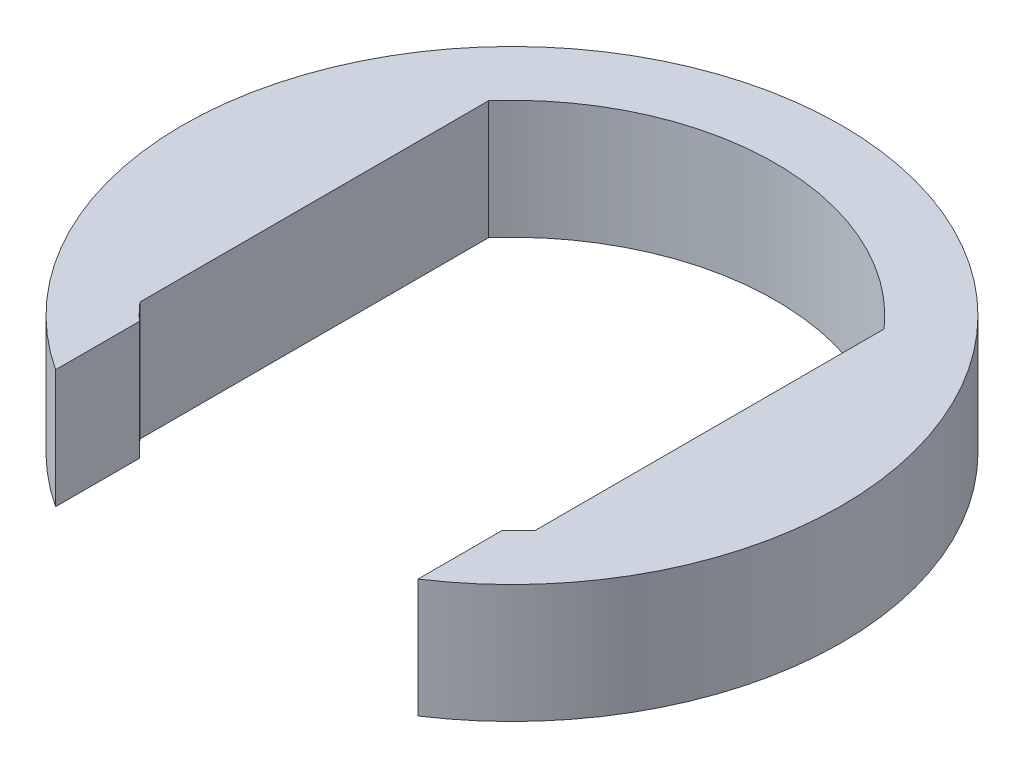
ISO-10303-21;
HEADER;
FILE_DESCRIPTION(('STEP AP214'),'2;1');
FILE_NAME('part.step','',(''),(''),'','','');
FILE_SCHEMA(('AUTOMOTIVE_DESIGN { 1 0 10303 214 1 1 1 1 }'));
ENDSEC;
DATA;
#1=APPLICATION_CONTEXT('core data for automotive mechanical design processes');
#2=APPLICATION_PROTOCOL_DEFINITION('international standard','automotive_design',2000,#1);
#3=PRODUCT_CONTEXT('',#1,'mechanical');
#4=PRODUCT('Part','Part','',(#3));
#5=PRODUCT_RELATED_PRODUCT_CATEGORY('part','',(#4));
#6=PRODUCT_DEFINITION_FORMATION('','',#4);
#7=PRODUCT_DEFINITION_CONTEXT('part definition',#1,'design');
#8=PRODUCT_DEFINITION('design','',#6,#7);
#9=PRODUCT_DEFINITION_SHAPE('','',#8);
#10=(LENGTH_UNIT() NAMED_UNIT(*) SI_UNIT(.MILLI.,.METRE.));
#11=(NAMED_UNIT(*) PLANE_ANGLE_UNIT() SI_UNIT($,.RADIAN.));
#12=(NAMED_UNIT(*) SI_UNIT($,.STERADIAN.) SOLID_ANGLE_UNIT());
#13=UNCERTAINTY_MEASURE_WITH_UNIT(LENGTH_MEASURE(1.E-05),#10,'distance_accuracy_value','');
#14=(GEOMETRIC_REPRESENTATION_CONTEXT(3) GLOBAL_UNCERTAINTY_ASSIGNED_CONTEXT((#13)) GLOBAL_UNIT_ASSIGNED_CONTEXT((#10,
#11,#12)) REPRESENTATION_CONTEXT('',''));
#15=CARTESIAN_POINT('',(0.,0.,0.));
#16=DIRECTION('',(0.,0.,1.));
#17=DIRECTION('',(1.,0.,0.));
#18=AXIS2_PLACEMENT_3D('',#15,#16,#17);
#19=CARTESIAN_POINT('',(0.,1.8,0.));
#20=DIRECTION('',(0.,-1.,0.));
#21=DIRECTION('',(0.,0.,-1.));
#22=AXIS2_PLACEMENT_3D('',#19,#20,#21);
#23=CYLINDRICAL_SURFACE('',#22,5.);
#24=CARTESIAN_POINT('',(0.,1.8,0.));
#25=DIRECTION('',(0.,1.,0.));
#26=DIRECTION('',(0.,0.,1.));
#27=AXIS2_PLACEMENT_3D('',#24,#25,#26);
#28=CIRCLE('',#27,5.);
#29=CARTESIAN_POINT('',(2.75,1.8,4.17582327212252));
#30=VERTEX_POINT('',#29);
#31=CARTESIAN_POINT('',(-2.75,1.8,4.17582327212251));
#32=VERTEX_POINT('',#31);
#33=EDGE_CURVE('E11',#30,#32,#28,.T.);
#34=ORIENTED_EDGE('',*,*,#33,.F.);
#35=DIRECTION('',(0.,1.,0.));
#36=VECTOR('',#35,1.);
#37=CARTESIAN_POINT('',(2.75,0.,4.17582327212252));
#38=LINE('',#37,#36);
#39=CARTESIAN_POINT('',(2.75,0.,4.17582327212252));
#40=VERTEX_POINT('',#39);
#41=EDGE_CURVE('E116',#40,#30,#38,.T.);
#42=ORIENTED_EDGE('',*,*,#41,.F.);
#43=CARTESIAN_POINT('',(0.,0.,0.));
#44=DIRECTION('',(0.,1.,0.));
#45=DIRECTION('',(0.,0.,1.));
#46=AXIS2_PLACEMENT_3D('',#43,#44,#45);
#47=CIRCLE('',#46,5.);
#48=CARTESIAN_POINT('',(-2.75,0.,4.17582327212251));
#49=VERTEX_POINT('',#48);
#50=EDGE_CURVE('E39',#40,#49,#47,.T.);
#51=ORIENTED_EDGE('',*,*,#50,.T.);
#52=DIRECTION('',(0.,1.,0.));
#53=VECTOR('',#52,1.);
#54=CARTESIAN_POINT('',(-2.75,0.,4.17582327212251));
#55=LINE('',#54,#53);
#56=EDGE_CURVE('E154',#49,#32,#55,.T.);
#57=ORIENTED_EDGE('',*,*,#56,.T.);
#58=EDGE_LOOP('',(#34,#42,#51,#57));
#59=FACE_BOUND('',#58,.T.);
#60=ADVANCED_FACE('F36',(#59),#23,.T.);
#61=CARTESIAN_POINT('',(0.,1.8,0.));
#62=DIRECTION('',(0.,1.,0.));
#63=DIRECTION('',(0.,0.,1.));
#64=AXIS2_PLACEMENT_3D('',#61,#62,#63);
#65=PLANE('',#64);
#66=DIRECTION('',(0.,0.,-1.));
#67=VECTOR('',#66,1.);
#68=CARTESIAN_POINT('',(2.75,1.8,2.90473750965556));
#69=LINE('',#68,#67);
#70=CARTESIAN_POINT('',(2.75,1.8,2.90473750965556));
#71=VERTEX_POINT('',#70);
#72=EDGE_CURVE('E111',#30,#71,#69,.T.);
#73=ORIENTED_EDGE('',*,*,#72,.F.);
#74=ORIENTED_EDGE('',*,*,#33,.T.);
#75=DIRECTION('',(0.,0.,1.));
#76=VECTOR('',#75,1.);
#77=CARTESIAN_POINT('',(-2.75,1.8,2.90473750965556));
#78=LINE('',#77,#76);
#79=CARTESIAN_POINT('',(-2.75,1.8,2.90473750965556));
#80=VERTEX_POINT('',#79);
#81=EDGE_CURVE('E143',#80,#32,#78,.T.);
#82=ORIENTED_EDGE('',*,*,#81,.F.);
#83=CARTESIAN_POINT('',(0.,1.8,0.));
#84=DIRECTION('',(0.,1.,0.));
#85=DIRECTION('',(0.,0.,1.));
#86=AXIS2_PLACEMENT_3D('',#83,#84,#85);
#87=CIRCLE('',#86,4.);
#88=CARTESIAN_POINT('',(-3.,1.8,2.64575131106459));
#89=VERTEX_POINT('',#88);
#90=EDGE_CURVE('E140',#89,#80,#87,.T.);
#91=ORIENTED_EDGE('',*,*,#90,.F.);
#92=DIRECTION('',(0.,0.,1.));
#93=VECTOR('',#92,1.);
#94=CARTESIAN_POINT('',(-3.,1.8,-2.64575131106459));
#95=LINE('',#94,#93);
#96=CARTESIAN_POINT('',(-3.,1.8,-2.64575131106459));
#97=VERTEX_POINT('',#96);
#98=EDGE_CURVE('E137',#97,#89,#95,.T.);
#99=ORIENTED_EDGE('',*,*,#98,.F.);
#100=CARTESIAN_POINT('',(0.,1.8,0.));
#101=DIRECTION('',(0.,1.,0.));
#102=DIRECTION('',(0.,0.,-1.));
#103=AXIS2_PLACEMENT_3D('',#100,#101,#102);
#104=CIRCLE('',#103,4.);
#105=CARTESIAN_POINT('',(3.,1.8,-2.64575131106459));
#106=VERTEX_POINT('',#105);
#107=EDGE_CURVE('E135',#106,#97,#104,.T.);
#108=ORIENTED_EDGE('',*,*,#107,.F.);
#109=DIRECTION('',(0.,0.,-1.));
#110=VECTOR('',#109,1.);
#111=CARTESIAN_POINT('',(3.,1.8,-2.64575131106459));
#112=LINE('',#111,#110);
#113=CARTESIAN_POINT('',(3.,1.8,2.64575131106459));
#114=VERTEX_POINT('',#113);
#115=EDGE_CURVE('E148',#114,#106,#112,.T.);
#116=ORIENTED_EDGE('',*,*,#115,.F.);
#117=CARTESIAN_POINT('',(0.,1.8,0.));
#118=DIRECTION('',(0.,1.,0.));
#119=DIRECTION('',(0.,0.,-1.));
#120=AXIS2_PLACEMENT_3D('',#117,#118,#119);
#121=CIRCLE('',#120,4.);
#122=EDGE_CURVE('E146',#71,#114,#121,.T.);
#123=ORIENTED_EDGE('',*,*,#122,.F.);
#124=EDGE_LOOP('',(#73,#74,#82,#91,#99,#108,#116,#123));
#125=FACE_BOUND('',#124,.T.);
#126=ADVANCED_FACE('F172',(#125),#65,.T.);
#127=CARTESIAN_POINT('',(0.,0.,0.));
#128=DIRECTION('',(0.,1.,0.));
#129=DIRECTION('',(0.,0.,1.));
#130=AXIS2_PLACEMENT_3D('',#127,#128,#129);
#131=PLANE('',#130);
#132=ORIENTED_EDGE('',*,*,#50,.F.);
#133=DIRECTION('',(0.,0.,-1.));
#134=VECTOR('',#133,1.);
#135=CARTESIAN_POINT('',(2.75,0.,2.90473750965556));
#136=LINE('',#135,#134);
#137=CARTESIAN_POINT('',(2.75,0.,2.90473750965556));
#138=VERTEX_POINT('',#137);
#139=EDGE_CURVE('E108',#40,#138,#136,.T.);
#140=ORIENTED_EDGE('',*,*,#139,.T.);
#141=CARTESIAN_POINT('',(0.,0.,0.));
#142=DIRECTION('',(0.,1.,0.));
#143=DIRECTION('',(0.,0.,-1.));
#144=AXIS2_PLACEMENT_3D('',#141,#142,#143);
#145=CIRCLE('',#144,4.);
#146=CARTESIAN_POINT('',(3.,0.,2.64575131106459));
#147=VERTEX_POINT('',#146);
#148=EDGE_CURVE('E119',#138,#147,#145,.T.);
#149=ORIENTED_EDGE('',*,*,#148,.T.);
#150=DIRECTION('',(0.,0.,-1.));
#151=VECTOR('',#150,1.);
#152=CARTESIAN_POINT('',(3.,0.,-2.64575131106459));
#153=LINE('',#152,#151);
#154=CARTESIAN_POINT('',(3.,0.,-2.64575131106459));
#155=VERTEX_POINT('',#154);
#156=EDGE_CURVE('E123',#147,#155,#153,.T.);
#157=ORIENTED_EDGE('',*,*,#156,.T.);
#158=CARTESIAN_POINT('',(0.,0.,0.));
#159=DIRECTION('',(0.,1.,0.));
#160=DIRECTION('',(0.,0.,-1.));
#161=AXIS2_PLACEMENT_3D('',#158,#159,#160);
#162=CIRCLE('',#161,4.);
#163=CARTESIAN_POINT('',(-3.,0.,-2.64575131106459));
#164=VERTEX_POINT('',#163);
#165=EDGE_CURVE('E150',#155,#164,#162,.T.);
#166=ORIENTED_EDGE('',*,*,#165,.T.);
#167=DIRECTION('',(0.,0.,1.));
#168=VECTOR('',#167,1.);
#169=CARTESIAN_POINT('',(-3.,0.,-2.64575131106459));
#170=LINE('',#169,#168);
#171=CARTESIAN_POINT('',(-3.,0.,2.64575131106459));
#172=VERTEX_POINT('',#171);
#173=EDGE_CURVE('E166',#164,#172,#170,.T.);
#174=ORIENTED_EDGE('',*,*,#173,.T.);
#175=CARTESIAN_POINT('',(0.,0.,0.));
#176=DIRECTION('',(0.,1.,0.));
#177=DIRECTION('',(0.,0.,1.));
#178=AXIS2_PLACEMENT_3D('',#175,#176,#177);
#179=CIRCLE('',#178,4.);
#180=CARTESIAN_POINT('',(-2.75,0.,2.90473750965556));
#181=VERTEX_POINT('',#180);
#182=EDGE_CURVE('E50',#172,#181,#179,.T.);
#183=ORIENTED_EDGE('',*,*,#182,.T.);
#184=DIRECTION('',(0.,0.,1.));
#185=VECTOR('',#184,1.);
#186=CARTESIAN_POINT('',(-2.75,0.,2.90473750965556));
#187=LINE('',#186,#185);
#188=EDGE_CURVE('E129',#181,#49,#187,.T.);
#189=ORIENTED_EDGE('',*,*,#188,.T.);
#190=EDGE_LOOP('',(#132,#140,#149,#157,#166,#174,#183,#189));
#191=FACE_BOUND('',#190,.T.);
#192=ADVANCED_FACE('F126',(#191),#131,.F.);
#193=CARTESIAN_POINT('',(0.,0.,0.));
#194=DIRECTION('',(0.,1.,0.));
#195=DIRECTION('',(0.,0.,1.));
#196=AXIS2_PLACEMENT_3D('',#193,#194,#195);
#197=CYLINDRICAL_SURFACE('',#196,4.);
#198=ORIENTED_EDGE('',*,*,#107,.T.);
#199=DIRECTION('',(0.,1.,0.));
#200=VECTOR('',#199,1.);
#201=CARTESIAN_POINT('',(-3.,0.,-2.64575131106459));
#202=LINE('',#201,#200);
#203=EDGE_CURVE('E92',#164,#97,#202,.T.);
#204=ORIENTED_EDGE('',*,*,#203,.F.);
#205=ORIENTED_EDGE('',*,*,#165,.F.);
#206=DIRECTION('',(0.,1.,0.));
#207=VECTOR('',#206,1.);
#208=CARTESIAN_POINT('',(3.,0.,-2.64575131106459));
#209=LINE('',#208,#207);
#210=EDGE_CURVE('E59',#155,#106,#209,.T.);
#211=ORIENTED_EDGE('',*,*,#210,.T.);
#212=EDGE_LOOP('',(#198,#204,#205,#211));
#213=FACE_BOUND('',#212,.T.);
#214=ADVANCED_FACE('F169',(#213),#197,.F.);
#215=CARTESIAN_POINT('',(3.,0.,-2.64575131106459));
#216=DIRECTION('',(1.,0.,0.));
#217=DIRECTION('',(0.,0.,-1.));
#218=AXIS2_PLACEMENT_3D('',#215,#216,#217);
#219=PLANE('',#218);
#220=ORIENTED_EDGE('',*,*,#115,.T.);
#221=ORIENTED_EDGE('',*,*,#210,.F.);
#222=ORIENTED_EDGE('',*,*,#156,.F.);
#223=DIRECTION('',(0.,1.,0.));
#224=VECTOR('',#223,1.);
#225=CARTESIAN_POINT('',(3.,0.,2.64575131106459));
#226=LINE('',#225,#224);
#227=EDGE_CURVE('E115',#147,#114,#226,.T.);
#228=ORIENTED_EDGE('',*,*,#227,.T.);
#229=EDGE_LOOP('',(#220,#221,#222,#228));
#230=FACE_BOUND('',#229,.T.);
#231=ADVANCED_FACE('F178',(#230),#219,.F.);
#232=CARTESIAN_POINT('',(0.,0.,0.));
#233=DIRECTION('',(0.,1.,0.));
#234=DIRECTION('',(0.,0.,1.));
#235=AXIS2_PLACEMENT_3D('',#232,#233,#234);
#236=CYLINDRICAL_SURFACE('',#235,4.);
#237=ORIENTED_EDGE('',*,*,#122,.T.);
#238=ORIENTED_EDGE('',*,*,#227,.F.);
#239=ORIENTED_EDGE('',*,*,#148,.F.);
#240=DIRECTION('',(0.,1.,0.));
#241=VECTOR('',#240,1.);
#242=CARTESIAN_POINT('',(2.75,0.,2.90473750965556));
#243=LINE('',#242,#241);
#244=EDGE_CURVE('E104',#138,#71,#243,.T.);
#245=ORIENTED_EDGE('',*,*,#244,.T.);
#246=EDGE_LOOP('',(#237,#238,#239,#245));
#247=FACE_BOUND('',#246,.T.);
#248=ADVANCED_FACE('F120',(#247),#236,.F.);
#249=CARTESIAN_POINT('',(2.75,0.,2.90473750965556));
#250=DIRECTION('',(1.,0.,0.));
#251=DIRECTION('',(0.,0.,-1.));
#252=AXIS2_PLACEMENT_3D('',#249,#250,#251);
#253=PLANE('',#252);
#254=ORIENTED_EDGE('',*,*,#72,.T.);
#255=ORIENTED_EDGE('',*,*,#244,.F.);
#256=ORIENTED_EDGE('',*,*,#139,.F.);
#257=ORIENTED_EDGE('',*,*,#41,.T.);
#258=EDGE_LOOP('',(#254,#255,#256,#257));
#259=FACE_BOUND('',#258,.T.);
#260=ADVANCED_FACE('F106',(#259),#253,.F.);
#261=CARTESIAN_POINT('',(-2.75,0.,2.90473750965556));
#262=DIRECTION('',(-1.,0.,0.));
#263=DIRECTION('',(0.,0.,1.));
#264=AXIS2_PLACEMENT_3D('',#261,#262,#263);
#265=PLANE('',#264);
#266=ORIENTED_EDGE('',*,*,#81,.T.);
#267=ORIENTED_EDGE('',*,*,#56,.F.);
#268=ORIENTED_EDGE('',*,*,#188,.F.);
#269=DIRECTION('',(0.,1.,0.));
#270=VECTOR('',#269,1.);
#271=CARTESIAN_POINT('',(-2.75,0.,2.90473750965556));
#272=LINE('',#271,#270);
#273=EDGE_CURVE('E157',#181,#80,#272,.T.);
#274=ORIENTED_EDGE('',*,*,#273,.T.);
#275=EDGE_LOOP('',(#266,#267,#268,#274));
#276=FACE_BOUND('',#275,.T.);
#277=ADVANCED_FACE('F182',(#276),#265,.F.);
#278=CARTESIAN_POINT('',(0.,0.,0.));
#279=DIRECTION('',(0.,1.,0.));
#280=DIRECTION('',(0.,0.,1.));
#281=AXIS2_PLACEMENT_3D('',#278,#279,#280);
#282=CYLINDRICAL_SURFACE('',#281,4.);
#283=ORIENTED_EDGE('',*,*,#90,.T.);
#284=ORIENTED_EDGE('',*,*,#273,.F.);
#285=ORIENTED_EDGE('',*,*,#182,.F.);
#286=DIRECTION('',(0.,1.,0.));
#287=VECTOR('',#286,1.);
#288=CARTESIAN_POINT('',(-3.,0.,2.64575131106459));
#289=LINE('',#288,#287);
#290=EDGE_CURVE('E159',#172,#89,#289,.T.);
#291=ORIENTED_EDGE('',*,*,#290,.T.);
#292=EDGE_LOOP('',(#283,#284,#285,#291));
#293=FACE_BOUND('',#292,.T.);
#294=ADVANCED_FACE('F174',(#293),#282,.F.);
#295=CARTESIAN_POINT('',(-3.,0.,-2.64575131106459));
#296=DIRECTION('',(-1.,0.,0.));
#297=DIRECTION('',(0.,0.,1.));
#298=AXIS2_PLACEMENT_3D('',#295,#296,#297);
#299=PLANE('',#298);
#300=ORIENTED_EDGE('',*,*,#98,.T.);
#301=ORIENTED_EDGE('',*,*,#290,.F.);
#302=ORIENTED_EDGE('',*,*,#173,.F.);
#303=ORIENTED_EDGE('',*,*,#203,.T.);
#304=EDGE_LOOP('',(#300,#301,#302,#303));
#305=FACE_BOUND('',#304,.T.);
#306=ADVANCED_FACE('F162',(#305),#299,.F.);
#307=CLOSED_SHELL('',(#60,#126,#192,#214,#231,#248,#260,#277,#294,#306));
#308=MANIFOLD_SOLID_BREP('B2',#307);
#309=ADVANCED_BREP_SHAPE_REPRESENTATION('',(#18,#308),#14);
#310=SHAPE_DEFINITION_REPRESENTATION(#9,#309);
ENDSEC;
END-ISO-10303-21;
